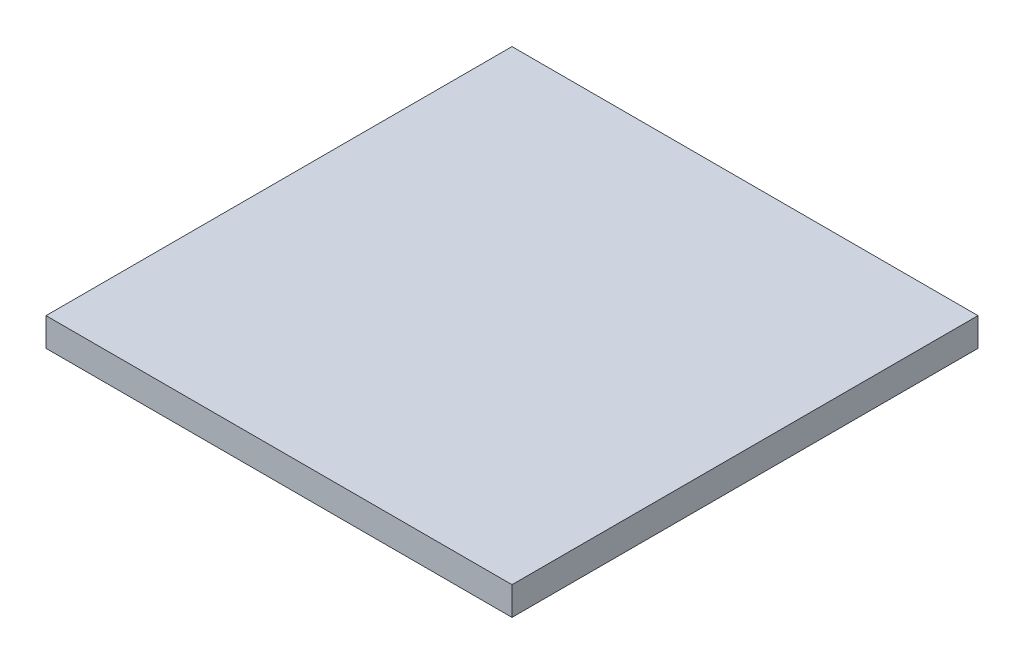
ISO-10303-21;
HEADER;
FILE_DESCRIPTION(('STEP AP214'),'2;1');
FILE_NAME('part.step','',(''),(''),'','','');
FILE_SCHEMA(('AUTOMOTIVE_DESIGN { 1 0 10303 214 1 1 1 1 }'));
ENDSEC;
DATA;
#1=APPLICATION_CONTEXT('core data for automotive mechanical design processes');
#2=APPLICATION_PROTOCOL_DEFINITION('international standard','automotive_design',2000,#1);
#3=PRODUCT_CONTEXT('',#1,'mechanical');
#4=PRODUCT('Part','Part','',(#3));
#5=PRODUCT_RELATED_PRODUCT_CATEGORY('part','',(#4));
#6=PRODUCT_DEFINITION_FORMATION('','',#4);
#7=PRODUCT_DEFINITION_CONTEXT('part definition',#1,'design');
#8=PRODUCT_DEFINITION('design','',#6,#7);
#9=PRODUCT_DEFINITION_SHAPE('','',#8);
#10=(LENGTH_UNIT() NAMED_UNIT(*) SI_UNIT(.MILLI.,.METRE.));
#11=(NAMED_UNIT(*) PLANE_ANGLE_UNIT() SI_UNIT($,.RADIAN.));
#12=(NAMED_UNIT(*) SI_UNIT($,.STERADIAN.) SOLID_ANGLE_UNIT());
#13=UNCERTAINTY_MEASURE_WITH_UNIT(LENGTH_MEASURE(1.E-05),#10,'distance_accuracy_value','');
#14=(GEOMETRIC_REPRESENTATION_CONTEXT(3) GLOBAL_UNCERTAINTY_ASSIGNED_CONTEXT((#13)) GLOBAL_UNIT_ASSIGNED_CONTEXT((#10,
#11,#12)) REPRESENTATION_CONTEXT('',''));
#15=CARTESIAN_POINT('',(0.,0.,0.));
#16=DIRECTION('',(0.,0.,1.));
#17=DIRECTION('',(1.,0.,0.));
#18=AXIS2_PLACEMENT_3D('',#15,#16,#17);
#19=CARTESIAN_POINT('',(0.,21.,0.));
#20=DIRECTION('',(1.,0.,0.));
#21=DIRECTION('',(0.,0.,-1.));
#22=AXIS2_PLACEMENT_3D('',#19,#20,#21);
#23=PLANE('',#22);
#24=DIRECTION('',(0.,0.,1.));
#25=VECTOR('',#24,1.);
#26=CARTESIAN_POINT('',(0.,0.,0.));
#27=LINE('',#26,#25);
#28=CARTESIAN_POINT('',(0.,0.,0.));
#29=VERTEX_POINT('',#28);
#30=CARTESIAN_POINT('',(0.,0.,345.));
#31=VERTEX_POINT('',#30);
#32=EDGE_CURVE('E97',#29,#31,#27,.T.);
#33=ORIENTED_EDGE('',*,*,#32,.T.);
#34=DIRECTION('',(0.,-1.,0.));
#35=VECTOR('',#34,1.);
#36=CARTESIAN_POINT('',(0.,21.,345.));
#37=LINE('',#36,#35);
#38=CARTESIAN_POINT('',(0.,21.,345.));
#39=VERTEX_POINT('',#38);
#40=EDGE_CURVE('E11',#39,#31,#37,.T.);
#41=ORIENTED_EDGE('',*,*,#40,.F.);
#42=DIRECTION('',(0.,0.,1.));
#43=VECTOR('',#42,1.);
#44=CARTESIAN_POINT('',(0.,21.,0.));
#45=LINE('',#44,#43);
#46=CARTESIAN_POINT('',(0.,21.,0.));
#47=VERTEX_POINT('',#46);
#48=EDGE_CURVE('E85',#47,#39,#45,.T.);
#49=ORIENTED_EDGE('',*,*,#48,.F.);
#50=DIRECTION('',(0.,-1.,0.));
#51=VECTOR('',#50,1.);
#52=CARTESIAN_POINT('',(0.,21.,0.));
#53=LINE('',#52,#51);
#54=EDGE_CURVE('E93',#47,#29,#53,.T.);
#55=ORIENTED_EDGE('',*,*,#54,.T.);
#56=EDGE_LOOP('',(#33,#41,#49,#55));
#57=FACE_BOUND('',#56,.T.);
#58=ADVANCED_FACE('F34',(#57),#23,.F.);
#59=CARTESIAN_POINT('',(0.,21.,345.));
#60=DIRECTION('',(0.,0.,-1.));
#61=DIRECTION('',(-1.,0.,0.));
#62=AXIS2_PLACEMENT_3D('',#59,#60,#61);
#63=PLANE('',#62);
#64=DIRECTION('',(1.,0.,0.));
#65=VECTOR('',#64,1.);
#66=CARTESIAN_POINT('',(0.,0.,345.));
#67=LINE('',#66,#65);
#68=CARTESIAN_POINT('',(345.,0.,345.));
#69=VERTEX_POINT('',#68);
#70=EDGE_CURVE('E89',#31,#69,#67,.T.);
#71=ORIENTED_EDGE('',*,*,#70,.T.);
#72=DIRECTION('',(0.,-1.,0.));
#73=VECTOR('',#72,1.);
#74=CARTESIAN_POINT('',(345.,21.,345.));
#75=LINE('',#74,#73);
#76=CARTESIAN_POINT('',(345.,21.,345.));
#77=VERTEX_POINT('',#76);
#78=EDGE_CURVE('E42',#77,#69,#75,.T.);
#79=ORIENTED_EDGE('',*,*,#78,.F.);
#80=DIRECTION('',(1.,0.,0.));
#81=VECTOR('',#80,1.);
#82=CARTESIAN_POINT('',(0.,21.,345.));
#83=LINE('',#82,#81);
#84=EDGE_CURVE('E80',#39,#77,#83,.T.);
#85=ORIENTED_EDGE('',*,*,#84,.F.);
#86=ORIENTED_EDGE('',*,*,#40,.T.);
#87=EDGE_LOOP('',(#71,#79,#85,#86));
#88=FACE_BOUND('',#87,.T.);
#89=ADVANCED_FACE('F88',(#88),#63,.F.);
#90=CARTESIAN_POINT('',(345.,21.,0.));
#91=DIRECTION('',(-1.,0.,0.));
#92=DIRECTION('',(0.,0.,1.));
#93=AXIS2_PLACEMENT_3D('',#90,#91,#92);
#94=PLANE('',#93);
#95=DIRECTION('',(0.,0.,-1.));
#96=VECTOR('',#95,1.);
#97=CARTESIAN_POINT('',(345.,0.,0.));
#98=LINE('',#97,#96);
#99=CARTESIAN_POINT('',(345.,0.,0.));
#100=VERTEX_POINT('',#99);
#101=EDGE_CURVE('E67',#69,#100,#98,.T.);
#102=ORIENTED_EDGE('',*,*,#101,.T.);
#103=DIRECTION('',(0.,-1.,0.));
#104=VECTOR('',#103,1.);
#105=CARTESIAN_POINT('',(345.,21.,0.));
#106=LINE('',#105,#104);
#107=CARTESIAN_POINT('',(345.,21.,0.));
#108=VERTEX_POINT('',#107);
#109=EDGE_CURVE('E90',#108,#100,#106,.T.);
#110=ORIENTED_EDGE('',*,*,#109,.F.);
#111=DIRECTION('',(0.,0.,-1.));
#112=VECTOR('',#111,1.);
#113=CARTESIAN_POINT('',(345.,21.,0.));
#114=LINE('',#113,#112);
#115=EDGE_CURVE('E83',#77,#108,#114,.T.);
#116=ORIENTED_EDGE('',*,*,#115,.F.);
#117=ORIENTED_EDGE('',*,*,#78,.T.);
#118=EDGE_LOOP('',(#102,#110,#116,#117));
#119=FACE_BOUND('',#118,.T.);
#120=ADVANCED_FACE('F91',(#119),#94,.F.);
#121=CARTESIAN_POINT('',(0.,21.,0.));
#122=DIRECTION('',(0.,0.,1.));
#123=DIRECTION('',(1.,0.,0.));
#124=AXIS2_PLACEMENT_3D('',#121,#122,#123);
#125=PLANE('',#124);
#126=DIRECTION('',(-1.,0.,0.));
#127=VECTOR('',#126,1.);
#128=CARTESIAN_POINT('',(0.,0.,0.));
#129=LINE('',#128,#127);
#130=EDGE_CURVE('E73',#100,#29,#129,.T.);
#131=ORIENTED_EDGE('',*,*,#130,.T.);
#132=ORIENTED_EDGE('',*,*,#54,.F.);
#133=DIRECTION('',(-1.,0.,0.));
#134=VECTOR('',#133,1.);
#135=CARTESIAN_POINT('',(0.,21.,0.));
#136=LINE('',#135,#134);
#137=EDGE_CURVE('E50',#108,#47,#136,.T.);
#138=ORIENTED_EDGE('',*,*,#137,.F.);
#139=ORIENTED_EDGE('',*,*,#109,.T.);
#140=EDGE_LOOP('',(#131,#132,#138,#139));
#141=FACE_BOUND('',#140,.T.);
#142=ADVANCED_FACE('F104',(#141),#125,.F.);
#143=CARTESIAN_POINT('',(0.,21.,0.));
#144=DIRECTION('',(0.,1.,0.));
#145=DIRECTION('',(0.,0.,1.));
#146=AXIS2_PLACEMENT_3D('',#143,#144,#145);
#147=PLANE('',#146);
#148=ORIENTED_EDGE('',*,*,#48,.T.);
#149=ORIENTED_EDGE('',*,*,#84,.T.);
#150=ORIENTED_EDGE('',*,*,#115,.T.);
#151=ORIENTED_EDGE('',*,*,#137,.T.);
#152=EDGE_LOOP('',(#148,#149,#150,#151));
#153=FACE_BOUND('',#152,.T.);
#154=ADVANCED_FACE('F81',(#153),#147,.T.);
#155=CARTESIAN_POINT('',(0.,0.,0.));
#156=DIRECTION('',(0.,1.,0.));
#157=DIRECTION('',(0.,0.,1.));
#158=AXIS2_PLACEMENT_3D('',#155,#156,#157);
#159=PLANE('',#158);
#160=ORIENTED_EDGE('',*,*,#32,.F.);
#161=ORIENTED_EDGE('',*,*,#130,.F.);
#162=ORIENTED_EDGE('',*,*,#101,.F.);
#163=ORIENTED_EDGE('',*,*,#70,.F.);
#164=EDGE_LOOP('',(#160,#161,#162,#163));
#165=FACE_BOUND('',#164,.T.);
#166=ADVANCED_FACE('F107',(#165),#159,.F.);
#167=CLOSED_SHELL('',(#58,#89,#120,#142,#154,#166));
#168=MANIFOLD_SOLID_BREP('B2',#167);
#169=ADVANCED_BREP_SHAPE_REPRESENTATION('',(#18,#168),#14);
#170=SHAPE_DEFINITION_REPRESENTATION(#9,#169);
ENDSEC;
END-ISO-10303-21;
